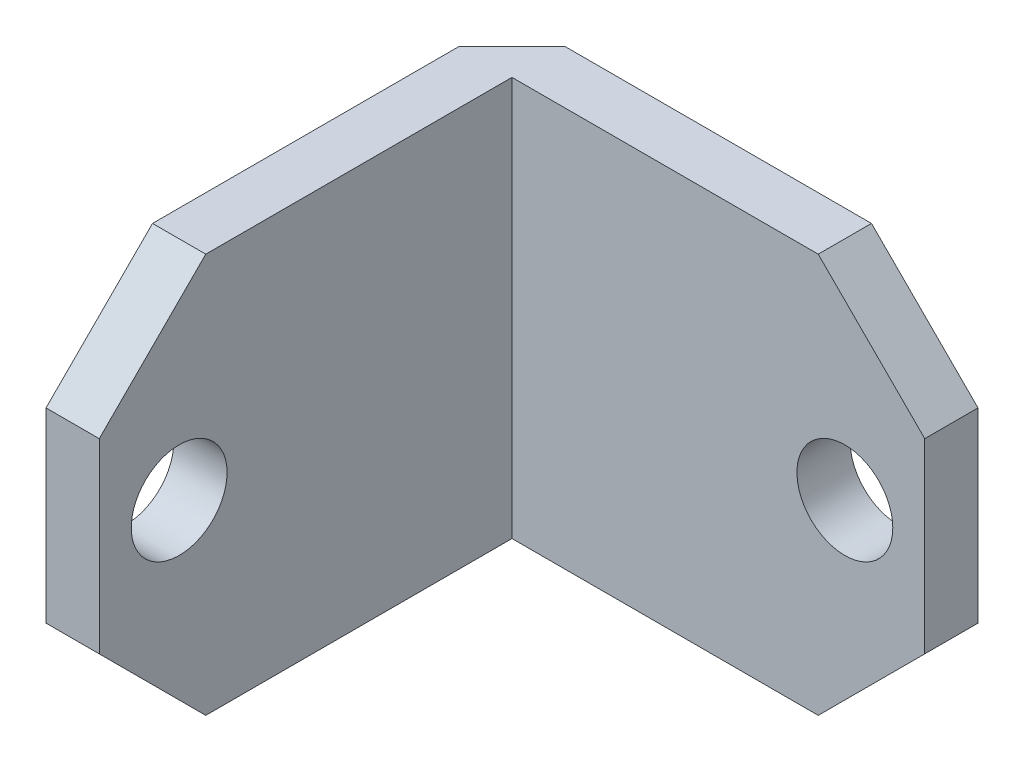
ISO-10303-21;
HEADER;
FILE_DESCRIPTION(('STEP AP214'),'2;1');
FILE_NAME('part.step','',(''),(''),'','','');
FILE_SCHEMA(('AUTOMOTIVE_DESIGN { 1 0 10303 214 1 1 1 1 }'));
ENDSEC;
DATA;
#1=APPLICATION_CONTEXT('core data for automotive mechanical design processes');
#2=APPLICATION_PROTOCOL_DEFINITION('international standard','automotive_design',2000,#1);
#3=PRODUCT_CONTEXT('',#1,'mechanical');
#4=PRODUCT('Part','Part','',(#3));
#5=PRODUCT_RELATED_PRODUCT_CATEGORY('part','',(#4));
#6=PRODUCT_DEFINITION_FORMATION('','',#4);
#7=PRODUCT_DEFINITION_CONTEXT('part definition',#1,'design');
#8=PRODUCT_DEFINITION('design','',#6,#7);
#9=PRODUCT_DEFINITION_SHAPE('','',#8);
#10=(LENGTH_UNIT() NAMED_UNIT(*) SI_UNIT(.MILLI.,.METRE.));
#11=(NAMED_UNIT(*) PLANE_ANGLE_UNIT() SI_UNIT($,.RADIAN.));
#12=(NAMED_UNIT(*) SI_UNIT($,.STERADIAN.) SOLID_ANGLE_UNIT());
#13=UNCERTAINTY_MEASURE_WITH_UNIT(LENGTH_MEASURE(1.E-05),#10,'distance_accuracy_value','');
#14=(GEOMETRIC_REPRESENTATION_CONTEXT(3) GLOBAL_UNCERTAINTY_ASSIGNED_CONTEXT((#13)) GLOBAL_UNIT_ASSIGNED_CONTEXT((#10,
#11,#12)) REPRESENTATION_CONTEXT('',''));
#15=CARTESIAN_POINT('',(0.,0.,0.));
#16=DIRECTION('',(0.,0.,1.));
#17=DIRECTION('',(1.,0.,0.));
#18=AXIS2_PLACEMENT_3D('',#15,#16,#17);
#19=CARTESIAN_POINT('',(22.225,19.05,0.));
#20=DIRECTION('',(1.,0.,0.));
#21=DIRECTION('',(0.,0.,-1.));
#22=AXIS2_PLACEMENT_3D('',#19,#20,#21);
#23=PLANE('',#22);
#24=DIRECTION('',(0.,-1.,0.));
#25=VECTOR('',#24,1.);
#26=CARTESIAN_POINT('',(22.225,19.05,-19.685));
#27=LINE('',#26,#25);
#28=CARTESIAN_POINT('',(22.225,13.97,-19.685));
#29=VERTEX_POINT('',#28);
#30=CARTESIAN_POINT('',(22.225,5.08000000000002,-19.685));
#31=VERTEX_POINT('',#30);
#32=EDGE_CURVE('E146',#29,#31,#27,.T.);
#33=ORIENTED_EDGE('',*,*,#32,.T.);
#34=DIRECTION('',(0.,0.,-1.));
#35=VECTOR('',#34,1.);
#36=CARTESIAN_POINT('',(22.225,5.08000000000002,-22.225));
#37=LINE('',#36,#35);
#38=CARTESIAN_POINT('',(22.225,5.08000000000002,-22.225));
#39=VERTEX_POINT('',#38);
#40=EDGE_CURVE('E196',#31,#39,#37,.T.);
#41=ORIENTED_EDGE('',*,*,#40,.T.);
#42=DIRECTION('',(0.,-1.,0.));
#43=VECTOR('',#42,1.);
#44=CARTESIAN_POINT('',(22.225,19.05,-22.225));
#45=LINE('',#44,#43);
#46=CARTESIAN_POINT('',(22.225,13.97,-22.225));
#47=VERTEX_POINT('',#46);
#48=EDGE_CURVE('E169',#47,#39,#45,.T.);
#49=ORIENTED_EDGE('',*,*,#48,.F.);
#50=DIRECTION('',(0.,0.,1.));
#51=VECTOR('',#50,1.);
#52=CARTESIAN_POINT('',(22.225,13.97,0.));
#53=LINE('',#52,#51);
#54=EDGE_CURVE('E193',#47,#29,#53,.T.);
#55=ORIENTED_EDGE('',*,*,#54,.T.);
#56=EDGE_LOOP('',(#33,#41,#49,#55));
#57=FACE_BOUND('',#56,.T.);
#58=ADVANCED_FACE('F40',(#57),#23,.T.);
#59=CARTESIAN_POINT('',(0.,19.05,-22.225));
#60=DIRECTION('',(0.,0.,-1.));
#61=DIRECTION('',(-1.,0.,0.));
#62=AXIS2_PLACEMENT_3D('',#59,#60,#61);
#63=PLANE('',#62);
#64=CARTESIAN_POINT('',(18.415,9.525,-22.225));
#65=DIRECTION('',(0.,0.,1.));
#66=DIRECTION('',(1.,0.,0.));
#67=AXIS2_PLACEMENT_3D('',#64,#65,#66);
#68=CIRCLE('',#67,2.286);
#69=CARTESIAN_POINT('',(20.701,9.525,-22.225));
#70=VERTEX_POINT('',#69);
#71=EDGE_CURVE('E159',#70,#70,#68,.T.);
#72=ORIENTED_EDGE('',*,*,#71,.T.);
#73=EDGE_LOOP('',(#72));
#74=FACE_BOUND('',#73,.T.);
#75=DIRECTION('',(1.,0.,0.));
#76=VECTOR('',#75,1.);
#77=CARTESIAN_POINT('',(0.,0.,-22.225));
#78=LINE('',#77,#76);
#79=CARTESIAN_POINT('',(2.54000000000002,0.,-22.225));
#80=VERTEX_POINT('',#79);
#81=CARTESIAN_POINT('',(17.145,0.,-22.225));
#82=VERTEX_POINT('',#81);
#83=EDGE_CURVE('E156',#80,#82,#78,.T.);
#84=ORIENTED_EDGE('',*,*,#83,.F.);
#85=DIRECTION('',(0.,1.,0.));
#86=VECTOR('',#85,1.);
#87=CARTESIAN_POINT('',(2.54000000000002,19.05,-22.225));
#88=LINE('',#87,#86);
#89=CARTESIAN_POINT('',(2.54000000000002,19.05,-22.225));
#90=VERTEX_POINT('',#89);
#91=EDGE_CURVE('E49',#80,#90,#88,.T.);
#92=ORIENTED_EDGE('',*,*,#91,.T.);
#93=DIRECTION('',(1.,0.,0.));
#94=VECTOR('',#93,1.);
#95=CARTESIAN_POINT('',(0.,19.05,-22.225));
#96=LINE('',#95,#94);
#97=CARTESIAN_POINT('',(17.145,19.05,-22.225));
#98=VERTEX_POINT('',#97);
#99=EDGE_CURVE('E163',#90,#98,#96,.T.);
#100=ORIENTED_EDGE('',*,*,#99,.T.);
#101=DIRECTION('',(-0.707106781186549,0.707106781186546,0.));
#102=VECTOR('',#101,1.);
#103=CARTESIAN_POINT('',(8.57249999999996,27.6225,-22.225));
#104=LINE('',#103,#102);
#105=EDGE_CURVE('E198',#98,#47,#104,.F.);
#106=ORIENTED_EDGE('',*,*,#105,.T.);
#107=ORIENTED_EDGE('',*,*,#48,.T.);
#108=DIRECTION('',(-0.707106781186546,-0.707106781186549,0.));
#109=VECTOR('',#108,1.);
#110=CARTESIAN_POINT('',(18.0975,0.952500000000044,-22.225));
#111=LINE('',#110,#109);
#112=EDGE_CURVE('E200',#39,#82,#111,.T.);
#113=ORIENTED_EDGE('',*,*,#112,.T.);
#114=EDGE_LOOP('',(#84,#92,#100,#106,#107,#113));
#115=FACE_BOUND('',#114,.T.);
#116=ADVANCED_FACE('F262',(#74,#115),#63,.T.);
#117=CARTESIAN_POINT('',(0.,19.05,0.));
#118=DIRECTION('',(-1.,0.,0.));
#119=DIRECTION('',(0.,0.,1.));
#120=AXIS2_PLACEMENT_3D('',#117,#118,#119);
#121=PLANE('',#120);
#122=CARTESIAN_POINT('',(0.,9.525,-3.81));
#123=DIRECTION('',(1.,0.,0.));
#124=DIRECTION('',(0.,0.,-1.));
#125=AXIS2_PLACEMENT_3D('',#122,#123,#124);
#126=CIRCLE('',#125,2.286);
#127=CARTESIAN_POINT('',(0.,9.525,-6.096));
#128=VERTEX_POINT('',#127);
#129=EDGE_CURVE('E235',#128,#128,#126,.T.);
#130=ORIENTED_EDGE('',*,*,#129,.T.);
#131=EDGE_LOOP('',(#130));
#132=FACE_BOUND('',#131,.T.);
#133=DIRECTION('',(0.,0.,-1.));
#134=VECTOR('',#133,1.);
#135=CARTESIAN_POINT('',(0.,19.05,0.));
#136=LINE('',#135,#134);
#137=CARTESIAN_POINT('',(0.,19.05,-5.07999999999999));
#138=VERTEX_POINT('',#137);
#139=CARTESIAN_POINT('',(0.,19.05,-19.685));
#140=VERTEX_POINT('',#139);
#141=EDGE_CURVE('E134',#138,#140,#136,.T.);
#142=ORIENTED_EDGE('',*,*,#141,.T.);
#143=DIRECTION('',(0.,-1.,0.));
#144=VECTOR('',#143,1.);
#145=CARTESIAN_POINT('',(0.,19.05,-19.685));
#146=LINE('',#145,#144);
#147=CARTESIAN_POINT('',(0.,0.,-19.685));
#148=VERTEX_POINT('',#147);
#149=EDGE_CURVE('E206',#140,#148,#146,.T.);
#150=ORIENTED_EDGE('',*,*,#149,.T.);
#151=DIRECTION('',(0.,0.,-1.));
#152=VECTOR('',#151,1.);
#153=CARTESIAN_POINT('',(0.,0.,0.));
#154=LINE('',#153,#152);
#155=CARTESIAN_POINT('',(0.,0.,-5.08000000000002));
#156=VERTEX_POINT('',#155);
#157=EDGE_CURVE('E158',#156,#148,#154,.T.);
#158=ORIENTED_EDGE('',*,*,#157,.F.);
#159=DIRECTION('',(0.,-0.707106781186546,-0.707106781186549));
#160=VECTOR('',#159,1.);
#161=CARTESIAN_POINT('',(0.,12.065,6.985));
#162=LINE('',#161,#160);
#163=CARTESIAN_POINT('',(0.,5.08,0.));
#164=VERTEX_POINT('',#163);
#165=EDGE_CURVE('E188',#156,#164,#162,.F.);
#166=ORIENTED_EDGE('',*,*,#165,.T.);
#167=DIRECTION('',(0.,-1.,0.));
#168=VECTOR('',#167,1.);
#169=CARTESIAN_POINT('',(0.,19.05,0.));
#170=LINE('',#169,#168);
#171=CARTESIAN_POINT('',(0.,13.97,0.));
#172=VERTEX_POINT('',#171);
#173=EDGE_CURVE('E166',#172,#164,#170,.T.);
#174=ORIENTED_EDGE('',*,*,#173,.F.);
#175=DIRECTION('',(0.,0.707106781186549,-0.707106781186546));
#176=VECTOR('',#175,1.);
#177=CARTESIAN_POINT('',(0.,16.51,-2.54000000000001));
#178=LINE('',#177,#176);
#179=EDGE_CURVE('E186',#172,#138,#178,.T.);
#180=ORIENTED_EDGE('',*,*,#179,.T.);
#181=EDGE_LOOP('',(#142,#150,#158,#166,#174,#180));
#182=FACE_BOUND('',#181,.T.);
#183=ADVANCED_FACE('F213',(#132,#182),#121,.T.);
#184=CARTESIAN_POINT('',(0.,19.05,0.));
#185=DIRECTION('',(0.,0.,-1.));
#186=DIRECTION('',(-1.,0.,0.));
#187=AXIS2_PLACEMENT_3D('',#184,#185,#186);
#188=PLANE('',#187);
#189=ORIENTED_EDGE('',*,*,#173,.T.);
#190=DIRECTION('',(1.,0.,0.));
#191=VECTOR('',#190,1.);
#192=CARTESIAN_POINT('',(0.,5.08,0.));
#193=LINE('',#192,#191);
#194=CARTESIAN_POINT('',(2.54,5.08,0.));
#195=VERTEX_POINT('',#194);
#196=EDGE_CURVE('E174',#164,#195,#193,.T.);
#197=ORIENTED_EDGE('',*,*,#196,.T.);
#198=DIRECTION('',(0.,-1.,0.));
#199=VECTOR('',#198,1.);
#200=CARTESIAN_POINT('',(2.54,19.05,0.));
#201=LINE('',#200,#199);
#202=CARTESIAN_POINT('',(2.54,13.97,0.));
#203=VERTEX_POINT('',#202);
#204=EDGE_CURVE('E145',#203,#195,#201,.T.);
#205=ORIENTED_EDGE('',*,*,#204,.F.);
#206=DIRECTION('',(-1.,0.,0.));
#207=VECTOR('',#206,1.);
#208=CARTESIAN_POINT('',(0.,13.97,0.));
#209=LINE('',#208,#207);
#210=EDGE_CURVE('E172',#203,#172,#209,.T.);
#211=ORIENTED_EDGE('',*,*,#210,.T.);
#212=EDGE_LOOP('',(#189,#197,#205,#211));
#213=FACE_BOUND('',#212,.T.);
#214=ADVANCED_FACE('F225',(#213),#188,.F.);
#215=CARTESIAN_POINT('',(2.54,19.05,0.));
#216=DIRECTION('',(-1.,0.,0.));
#217=DIRECTION('',(0.,0.,1.));
#218=AXIS2_PLACEMENT_3D('',#215,#216,#217);
#219=PLANE('',#218);
#220=CARTESIAN_POINT('',(2.54,9.525,-3.81));
#221=DIRECTION('',(1.,0.,0.));
#222=DIRECTION('',(0.,0.,-1.));
#223=AXIS2_PLACEMENT_3D('',#220,#221,#222);
#224=CIRCLE('',#223,2.286);
#225=CARTESIAN_POINT('',(2.54,9.525,-6.096));
#226=VERTEX_POINT('',#225);
#227=EDGE_CURVE('E238',#226,#226,#224,.T.);
#228=ORIENTED_EDGE('',*,*,#227,.F.);
#229=EDGE_LOOP('',(#228));
#230=FACE_BOUND('',#229,.T.);
#231=ORIENTED_EDGE('',*,*,#204,.T.);
#232=DIRECTION('',(0.,0.707106781186546,0.707106781186549));
#233=VECTOR('',#232,1.);
#234=CARTESIAN_POINT('',(2.54,5.08,0.));
#235=LINE('',#234,#233);
#236=CARTESIAN_POINT('',(2.54,0.,-5.08000000000002));
#237=VERTEX_POINT('',#236);
#238=EDGE_CURVE('E179',#195,#237,#235,.F.);
#239=ORIENTED_EDGE('',*,*,#238,.T.);
#240=DIRECTION('',(0.,0.,-1.));
#241=VECTOR('',#240,1.);
#242=CARTESIAN_POINT('',(2.54,0.,0.));
#243=LINE('',#242,#241);
#244=CARTESIAN_POINT('',(2.54,0.,-19.685));
#245=VERTEX_POINT('',#244);
#246=EDGE_CURVE('E141',#237,#245,#243,.T.);
#247=ORIENTED_EDGE('',*,*,#246,.T.);
#248=DIRECTION('',(0.,-1.,0.));
#249=VECTOR('',#248,1.);
#250=CARTESIAN_POINT('',(2.54,19.05,-19.685));
#251=LINE('',#250,#249);
#252=CARTESIAN_POINT('',(2.54,19.05,-19.685));
#253=VERTEX_POINT('',#252);
#254=EDGE_CURVE('E137',#253,#245,#251,.T.);
#255=ORIENTED_EDGE('',*,*,#254,.F.);
#256=DIRECTION('',(0.,0.,-1.));
#257=VECTOR('',#256,1.);
#258=CARTESIAN_POINT('',(2.54,19.05,0.));
#259=LINE('',#258,#257);
#260=CARTESIAN_POINT('',(2.54,19.05,-5.07999999999999));
#261=VERTEX_POINT('',#260);
#262=EDGE_CURVE('E123',#261,#253,#259,.T.);
#263=ORIENTED_EDGE('',*,*,#262,.F.);
#264=DIRECTION('',(0.,-0.707106781186549,0.707106781186546));
#265=VECTOR('',#264,1.);
#266=CARTESIAN_POINT('',(2.54,19.05,-5.07999999999999));
#267=LINE('',#266,#265);
#268=EDGE_CURVE('E177',#261,#203,#267,.T.);
#269=ORIENTED_EDGE('',*,*,#268,.T.);
#270=EDGE_LOOP('',(#231,#239,#247,#255,#263,#269));
#271=FACE_BOUND('',#270,.T.);
#272=ADVANCED_FACE('F139',(#230,#271),#219,.F.);
#273=CARTESIAN_POINT('',(0.,19.05,-19.685));
#274=DIRECTION('',(0.,0.,-1.));
#275=DIRECTION('',(-1.,0.,0.));
#276=AXIS2_PLACEMENT_3D('',#273,#274,#275);
#277=PLANE('',#276);
#278=CARTESIAN_POINT('',(18.415,9.525,-19.685));
#279=DIRECTION('',(0.,0.,1.));
#280=DIRECTION('',(1.,0.,0.));
#281=AXIS2_PLACEMENT_3D('',#278,#279,#280);
#282=CIRCLE('',#281,2.286);
#283=CARTESIAN_POINT('',(20.701,9.525,-19.685));
#284=VERTEX_POINT('',#283);
#285=EDGE_CURVE('E232',#284,#284,#282,.T.);
#286=ORIENTED_EDGE('',*,*,#285,.F.);
#287=EDGE_LOOP('',(#286));
#288=FACE_BOUND('',#287,.T.);
#289=DIRECTION('',(1.,0.,0.));
#290=VECTOR('',#289,1.);
#291=CARTESIAN_POINT('',(0.,0.,-19.685));
#292=LINE('',#291,#290);
#293=CARTESIAN_POINT('',(17.145,0.,-19.685));
#294=VERTEX_POINT('',#293);
#295=EDGE_CURVE('E162',#245,#294,#292,.T.);
#296=ORIENTED_EDGE('',*,*,#295,.T.);
#297=DIRECTION('',(0.707106781186546,0.707106781186549,0.));
#298=VECTOR('',#297,1.);
#299=CARTESIAN_POINT('',(17.145,0.,-19.685));
#300=LINE('',#299,#298);
#301=EDGE_CURVE('E191',#294,#31,#300,.T.);
#302=ORIENTED_EDGE('',*,*,#301,.T.);
#303=ORIENTED_EDGE('',*,*,#32,.F.);
#304=DIRECTION('',(0.707106781186549,-0.707106781186546,0.));
#305=VECTOR('',#304,1.);
#306=CARTESIAN_POINT('',(22.225,13.97,-19.685));
#307=LINE('',#306,#305);
#308=CARTESIAN_POINT('',(17.145,19.05,-19.685));
#309=VERTEX_POINT('',#308);
#310=EDGE_CURVE('E150',#29,#309,#307,.F.);
#311=ORIENTED_EDGE('',*,*,#310,.T.);
#312=DIRECTION('',(1.,0.,0.));
#313=VECTOR('',#312,1.);
#314=CARTESIAN_POINT('',(0.,19.05,-19.685));
#315=LINE('',#314,#313);
#316=EDGE_CURVE('E128',#253,#309,#315,.T.);
#317=ORIENTED_EDGE('',*,*,#316,.F.);
#318=ORIENTED_EDGE('',*,*,#254,.T.);
#319=EDGE_LOOP('',(#296,#302,#303,#311,#317,#318));
#320=FACE_BOUND('',#319,.T.);
#321=ADVANCED_FACE('F148',(#288,#320),#277,.F.);
#322=CARTESIAN_POINT('',(0.,19.05,0.));
#323=DIRECTION('',(0.,1.,0.));
#324=DIRECTION('',(0.,0.,1.));
#325=AXIS2_PLACEMENT_3D('',#322,#323,#324);
#326=PLANE('',#325);
#327=ORIENTED_EDGE('',*,*,#99,.F.);
#328=DIRECTION('',(0.707106781186549,0.,-0.707106781186546));
#329=VECTOR('',#328,1.);
#330=CARTESIAN_POINT('',(-9.8425,19.05,-9.84250000000003));
#331=LINE('',#330,#329);
#332=EDGE_CURVE('E11',#90,#140,#331,.F.);
#333=ORIENTED_EDGE('',*,*,#332,.T.);
#334=ORIENTED_EDGE('',*,*,#141,.F.);
#335=DIRECTION('',(1.,0.,0.));
#336=VECTOR('',#335,1.);
#337=CARTESIAN_POINT('',(2.54,19.05,-5.07999999999999));
#338=LINE('',#337,#336);
#339=EDGE_CURVE('E132',#138,#261,#338,.T.);
#340=ORIENTED_EDGE('',*,*,#339,.T.);
#341=ORIENTED_EDGE('',*,*,#262,.T.);
#342=ORIENTED_EDGE('',*,*,#316,.T.);
#343=DIRECTION('',(0.,0.,-1.));
#344=VECTOR('',#343,1.);
#345=CARTESIAN_POINT('',(17.145,19.05,0.));
#346=LINE('',#345,#344);
#347=EDGE_CURVE('E204',#309,#98,#346,.T.);
#348=ORIENTED_EDGE('',*,*,#347,.T.);
#349=EDGE_LOOP('',(#327,#333,#334,#340,#341,#342,#348));
#350=FACE_BOUND('',#349,.T.);
#351=ADVANCED_FACE('F125',(#350),#326,.T.);
#352=CARTESIAN_POINT('',(0.,0.,0.));
#353=DIRECTION('',(0.,1.,0.));
#354=DIRECTION('',(0.,0.,1.));
#355=AXIS2_PLACEMENT_3D('',#352,#353,#354);
#356=PLANE('',#355);
#357=ORIENTED_EDGE('',*,*,#157,.T.);
#358=DIRECTION('',(-0.707106781186549,0.,0.707106781186546));
#359=VECTOR('',#358,1.);
#360=CARTESIAN_POINT('',(0.,0.,-19.685));
#361=LINE('',#360,#359);
#362=EDGE_CURVE('E63',#148,#80,#361,.F.);
#363=ORIENTED_EDGE('',*,*,#362,.T.);
#364=ORIENTED_EDGE('',*,*,#83,.T.);
#365=DIRECTION('',(0.,0.,1.));
#366=VECTOR('',#365,1.);
#367=CARTESIAN_POINT('',(17.145,0.,-19.685));
#368=LINE('',#367,#366);
#369=EDGE_CURVE('E181',#82,#294,#368,.T.);
#370=ORIENTED_EDGE('',*,*,#369,.T.);
#371=ORIENTED_EDGE('',*,*,#295,.F.);
#372=ORIENTED_EDGE('',*,*,#246,.F.);
#373=DIRECTION('',(-1.,0.,0.));
#374=VECTOR('',#373,1.);
#375=CARTESIAN_POINT('',(0.,0.,-5.08000000000002));
#376=LINE('',#375,#374);
#377=EDGE_CURVE('E184',#237,#156,#376,.T.);
#378=ORIENTED_EDGE('',*,*,#377,.T.);
#379=EDGE_LOOP('',(#357,#363,#364,#370,#371,#372,#378));
#380=FACE_BOUND('',#379,.T.);
#381=ADVANCED_FACE('F217',(#380),#356,.F.);
#382=CARTESIAN_POINT('',(18.415,9.525,-22.225));
#383=DIRECTION('',(0.,0.,1.));
#384=DIRECTION('',(1.,0.,0.));
#385=AXIS2_PLACEMENT_3D('',#382,#383,#384);
#386=CYLINDRICAL_SURFACE('',#385,2.286);
#387=ORIENTED_EDGE('',*,*,#71,.F.);
#388=EDGE_LOOP('',(#387));
#389=FACE_BOUND('',#388,.T.);
#390=ORIENTED_EDGE('',*,*,#285,.T.);
#391=EDGE_LOOP('',(#390));
#392=FACE_BOUND('',#391,.T.);
#393=ADVANCED_FACE('F248',(#389,#392),#386,.F.);
#394=CARTESIAN_POINT('',(0.,9.525,-3.81));
#395=DIRECTION('',(1.,0.,0.));
#396=DIRECTION('',(0.,0.,-1.));
#397=AXIS2_PLACEMENT_3D('',#394,#395,#396);
#398=CYLINDRICAL_SURFACE('',#397,2.286);
#399=ORIENTED_EDGE('',*,*,#129,.F.);
#400=EDGE_LOOP('',(#399));
#401=FACE_BOUND('',#400,.T.);
#402=ORIENTED_EDGE('',*,*,#227,.T.);
#403=EDGE_LOOP('',(#402));
#404=FACE_BOUND('',#403,.T.);
#405=ADVANCED_FACE('F245',(#401,#404),#398,.F.);
#406=CARTESIAN_POINT('',(0.,5.08,0.));
#407=DIRECTION('',(0.,0.707106781186549,-0.707106781186546));
#408=DIRECTION('',(1.,0.,0.));
#409=AXIS2_PLACEMENT_3D('',#406,#407,#408);
#410=PLANE('',#409);
#411=ORIENTED_EDGE('',*,*,#165,.F.);
#412=ORIENTED_EDGE('',*,*,#377,.F.);
#413=ORIENTED_EDGE('',*,*,#238,.F.);
#414=ORIENTED_EDGE('',*,*,#196,.F.);
#415=EDGE_LOOP('',(#411,#412,#413,#414));
#416=FACE_BOUND('',#415,.T.);
#417=ADVANCED_FACE('F220',(#416),#410,.F.);
#418=CARTESIAN_POINT('',(17.145,0.,0.));
#419=DIRECTION('',(0.707106781186549,-0.707106781186546,0.));
#420=DIRECTION('',(0.,0.,-1.));
#421=AXIS2_PLACEMENT_3D('',#418,#419,#420);
#422=PLANE('',#421);
#423=ORIENTED_EDGE('',*,*,#112,.F.);
#424=ORIENTED_EDGE('',*,*,#40,.F.);
#425=ORIENTED_EDGE('',*,*,#301,.F.);
#426=ORIENTED_EDGE('',*,*,#369,.F.);
#427=EDGE_LOOP('',(#423,#424,#425,#426));
#428=FACE_BOUND('',#427,.T.);
#429=ADVANCED_FACE('F278',(#428),#422,.T.);
#430=CARTESIAN_POINT('',(22.225,13.97,0.));
#431=DIRECTION('',(-0.707106781186546,-0.707106781186549,0.));
#432=DIRECTION('',(0.,0.,1.));
#433=AXIS2_PLACEMENT_3D('',#430,#431,#432);
#434=PLANE('',#433);
#435=ORIENTED_EDGE('',*,*,#105,.F.);
#436=ORIENTED_EDGE('',*,*,#347,.F.);
#437=ORIENTED_EDGE('',*,*,#310,.F.);
#438=ORIENTED_EDGE('',*,*,#54,.F.);
#439=EDGE_LOOP('',(#435,#436,#437,#438));
#440=FACE_BOUND('',#439,.T.);
#441=ADVANCED_FACE('F284',(#440),#434,.F.);
#442=CARTESIAN_POINT('',(0.,19.05,-5.07999999999999));
#443=DIRECTION('',(0.,0.707106781186546,0.707106781186549));
#444=DIRECTION('',(-1.,0.,0.));
#445=AXIS2_PLACEMENT_3D('',#442,#443,#444);
#446=PLANE('',#445);
#447=ORIENTED_EDGE('',*,*,#179,.F.);
#448=ORIENTED_EDGE('',*,*,#210,.F.);
#449=ORIENTED_EDGE('',*,*,#268,.F.);
#450=ORIENTED_EDGE('',*,*,#339,.F.);
#451=EDGE_LOOP('',(#447,#448,#449,#450));
#452=FACE_BOUND('',#451,.T.);
#453=ADVANCED_FACE('F229',(#452),#446,.T.);
#454=CARTESIAN_POINT('',(0.,19.05,-19.685));
#455=DIRECTION('',(0.707106781186546,0.,0.707106781186549));
#456=DIRECTION('',(0.,-1.,0.));
#457=AXIS2_PLACEMENT_3D('',#454,#455,#456);
#458=PLANE('',#457);
#459=ORIENTED_EDGE('',*,*,#332,.F.);
#460=ORIENTED_EDGE('',*,*,#91,.F.);
#461=ORIENTED_EDGE('',*,*,#362,.F.);
#462=ORIENTED_EDGE('',*,*,#149,.F.);
#463=EDGE_LOOP('',(#459,#460,#461,#462));
#464=FACE_BOUND('',#463,.T.);
#465=ADVANCED_FACE('F43',(#464),#458,.F.);
#466=CLOSED_SHELL('',(#58,#116,#183,#214,#272,#321,#351,#381,#393,#405,#417,#429,#441,#453,#465));
#467=MANIFOLD_SOLID_BREP('B2',#466);
#468=ADVANCED_BREP_SHAPE_REPRESENTATION('',(#18,#467),#14);
#469=SHAPE_DEFINITION_REPRESENTATION(#9,#468);
ENDSEC;
END-ISO-10303-21;
